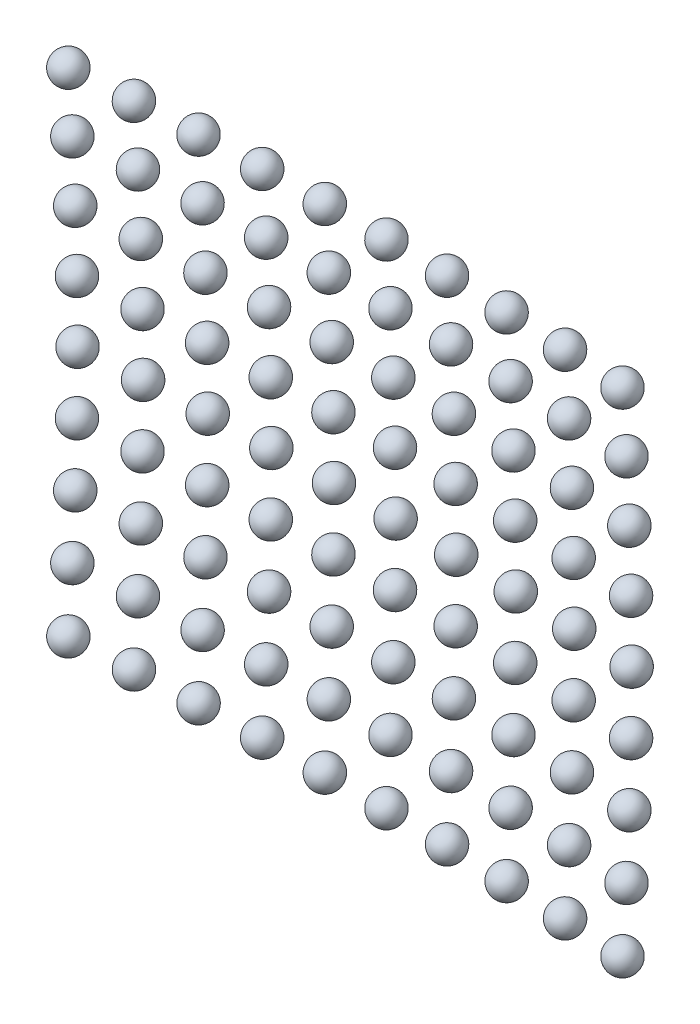
ISO-10303-21;
HEADER;
FILE_DESCRIPTION(('STEP AP214'),'2;1');
FILE_NAME('part.step','',(''),(''),'','','');
FILE_SCHEMA(('AUTOMOTIVE_DESIGN { 1 0 10303 214 1 1 1 1 }'));
ENDSEC;
DATA;
#1=APPLICATION_CONTEXT('core data for automotive mechanical design processes');
#2=APPLICATION_PROTOCOL_DEFINITION('international standard','automotive_design',2000,#1);
#3=PRODUCT_CONTEXT('',#1,'mechanical');
#4=PRODUCT('Part','Part','',(#3));
#5=PRODUCT_RELATED_PRODUCT_CATEGORY('part','',(#4));
#6=PRODUCT_DEFINITION_FORMATION('','',#4);
#7=PRODUCT_DEFINITION_CONTEXT('part definition',#1,'design');
#8=PRODUCT_DEFINITION('design','',#6,#7);
#9=PRODUCT_DEFINITION_SHAPE('','',#8);
#10=(LENGTH_UNIT() NAMED_UNIT(*) SI_UNIT(.MILLI.,.METRE.));
#11=(NAMED_UNIT(*) PLANE_ANGLE_UNIT() SI_UNIT($,.RADIAN.));
#12=(NAMED_UNIT(*) SI_UNIT($,.STERADIAN.) SOLID_ANGLE_UNIT());
#13=UNCERTAINTY_MEASURE_WITH_UNIT(LENGTH_MEASURE(1.E-05),#10,'distance_accuracy_value','');
#14=(GEOMETRIC_REPRESENTATION_CONTEXT(3) GLOBAL_UNCERTAINTY_ASSIGNED_CONTEXT((#13)) GLOBAL_UNIT_ASSIGNED_CONTEXT((#10,
#11,#12)) REPRESENTATION_CONTEXT('',''));
#15=CARTESIAN_POINT('',(0.,0.,0.));
#16=DIRECTION('',(0.,0.,1.));
#17=DIRECTION('',(1.,0.,0.));
#18=AXIS2_PLACEMENT_3D('',#15,#16,#17);
#19=CARTESIAN_POINT('',(8.00817179263602,-8.9214419487475,0.747647017793937));
#20=DIRECTION('',(0.,0.,-1.));
#21=DIRECTION('',(0.,-1.,0.));
#22=AXIS2_PLACEMENT_3D('',#19,#20,#21);
#23=SPHERICAL_SURFACE('',#22,0.5);
#24=CARTESIAN_POINT('',(8.00817179263602,-8.9214419487475,0.247647017793937));
#25=VERTEX_POINT('',#24);
#26=VERTEX_LOOP('',#25);
#27=FACE_BOUND('',#26,.T.);
#28=ADVANCED_FACE('F43',(#27),#23,.T.);
#29=CLOSED_SHELL('',(#28));
#30=MANIFOLD_SOLID_BREP('B2',#29);
#31=CARTESIAN_POINT('',(6.01259338943925,-8.9214419487475,0.615076387186788));
#32=DIRECTION('',(0.,0.,-1.));
#33=DIRECTION('',(0.,-1.,0.));
#34=AXIS2_PLACEMENT_3D('',#31,#32,#33);
#35=SPHERICAL_SURFACE('',#34,0.5);
#36=CARTESIAN_POINT('',(6.01259338943925,-8.9214419487475,0.115076387186788));
#37=VERTEX_POINT('',#36);
#38=VERTEX_LOOP('',#37);
#39=FACE_BOUND('',#38,.T.);
#40=ADVANCED_FACE('F63',(#39),#35,.T.);
#41=CLOSED_SHELL('',(#40));
#42=MANIFOLD_SOLID_BREP('B6',#41);
#43=CARTESIAN_POINT('',(4.01508925056326,-8.9214419487475,0.515651286844554));
#44=DIRECTION('',(0.,0.,-1.));
#45=DIRECTION('',(0.,-1.,0.));
#46=AXIS2_PLACEMENT_3D('',#43,#44,#45);
#47=SPHERICAL_SURFACE('',#46,0.5);
#48=CARTESIAN_POINT('',(4.01508925056326,-8.9214419487475,0.0156512868445537));
#49=VERTEX_POINT('',#48);
#50=VERTEX_LOOP('',#49);
#51=FACE_BOUND('',#50,.T.);
#52=ADVANCED_FACE('F83',(#51),#47,.T.);
#53=CLOSED_SHELL('',(#52));
#54=MANIFOLD_SOLID_BREP('B39',#53);
#55=CARTESIAN_POINT('',(2.01620986814937,-8.9214419487475,0.449399117329413));
#56=DIRECTION('',(0.,0.,-1.));
#57=DIRECTION('',(0.,-1.,0.));
#58=AXIS2_PLACEMENT_3D('',#55,#56,#57);
#59=SPHERICAL_SURFACE('',#58,0.5);
#60=CARTESIAN_POINT('',(2.01620986814937,-8.9214419487475,-0.0506008826705871));
#61=VERTEX_POINT('',#60);
#62=VERTEX_LOOP('',#61);
#63=FACE_BOUND('',#62,.T.);
#64=ADVANCED_FACE('F103',(#63),#59,.T.);
#65=CLOSED_SHELL('',(#64));
#66=MANIFOLD_SOLID_BREP('B59',#65);
#67=CARTESIAN_POINT('',(0.0165061133422777,-8.9214419487475,0.416338137075991));
#68=DIRECTION('',(0.,0.,-1.));
#69=DIRECTION('',(0.,-1.,0.));
#70=AXIS2_PLACEMENT_3D('',#67,#68,#69);
#71=SPHERICAL_SURFACE('',#70,0.5);
#72=CARTESIAN_POINT('',(0.0165061133422777,-8.9214419487475,-0.0836618629240086));
#73=VERTEX_POINT('',#72);
#74=VERTEX_LOOP('',#73);
#75=FACE_BOUND('',#74,.T.);
#76=ADVANCED_FACE('F123',(#75),#71,.T.);
#77=CLOSED_SHELL('',(#76));
#78=MANIFOLD_SOLID_BREP('B79',#77);
#79=CARTESIAN_POINT('',(-1.98347091552447,-8.9214419487475,0.416477457359412));
#80=DIRECTION('',(0.,0.,-1.));
#81=DIRECTION('',(0.,-1.,0.));
#82=AXIS2_PLACEMENT_3D('',#79,#80,#81);
#83=SPHERICAL_SURFACE('',#82,0.5);
#84=CARTESIAN_POINT('',(-1.98347091552447,-8.9214419487475,-0.0835225426405876));
#85=VERTEX_POINT('',#84);
#86=VERTEX_LOOP('',#85);
#87=FACE_BOUND('',#86,.T.);
#88=ADVANCED_FACE('F143',(#87),#83,.T.);
#89=CLOSED_SHELL('',(#88));
#90=MANIFOLD_SOLID_BREP('B99',#89);
#91=CARTESIAN_POINT('',(-3.98317004480583,-8.9214419487475,0.449817039784403));
#92=DIRECTION('',(0.,0.,-1.));
#93=DIRECTION('',(0.,-1.,0.));
#94=AXIS2_PLACEMENT_3D('',#91,#92,#93);
#95=SPHERICAL_SURFACE('',#94,0.5);
#96=CARTESIAN_POINT('',(-3.98317004480583,-8.9214419487475,-0.0501829602155971));
#97=VERTEX_POINT('',#96);
#98=VERTEX_LOOP('',#97);
#99=FACE_BOUND('',#98,.T.);
#100=ADVANCED_FACE('F163',(#99),#95,.T.);
#101=CLOSED_SHELL('',(#100));
#102=MANIFOLD_SOLID_BREP('B119',#101);
#103=CARTESIAN_POINT('',(-5.982040177443,-8.9214419487475,0.516347696295841));
#104=DIRECTION('',(0.,0.,-1.));
#105=DIRECTION('',(0.,-1.,0.));
#106=AXIS2_PLACEMENT_3D('',#103,#104,#105);
#107=SPHERICAL_SURFACE('',#106,0.5);
#108=CARTESIAN_POINT('',(-5.982040177443,-8.9214419487475,0.0163476962958405));
#109=VERTEX_POINT('',#108);
#110=VERTEX_LOOP('',#109);
#111=FACE_BOUND('',#110,.T.);
#112=ADVANCED_FACE('F183',(#111),#107,.T.);
#113=CLOSED_SHELL('',(#112));
#114=MANIFOLD_SOLID_BREP('B139',#113);
#115=CARTESIAN_POINT('',(-7.97953044484047,-8.9214419487475,0.616051091710923));
#116=DIRECTION('',(0.,0.,-1.));
#117=DIRECTION('',(0.,-1.,0.));
#118=AXIS2_PLACEMENT_3D('',#115,#116,#117);
#119=SPHERICAL_SURFACE('',#118,0.5);
#120=CARTESIAN_POINT('',(-7.97953044484047,-8.9214419487475,0.116051091710923));
#121=VERTEX_POINT('',#120);
#122=VERTEX_LOOP('',#121);
#123=FACE_BOUND('',#122,.T.);
#124=ADVANCED_FACE('F203',(#123),#119,.T.);
#125=CLOSED_SHELL('',(#124));
#126=MANIFOLD_SOLID_BREP('B159',#125);
#127=CARTESIAN_POINT('',(-9.97509035867965,-8.9214419487475,0.748899748772111));
#128=DIRECTION('',(0.,0.,-1.));
#129=DIRECTION('',(0.,-1.,0.));
#130=AXIS2_PLACEMENT_3D('',#127,#128,#129);
#131=SPHERICAL_SURFACE('',#130,0.5);
#132=CARTESIAN_POINT('',(-9.97509035867965,-8.9214419487475,0.248899748772111));
#133=VERTEX_POINT('',#132);
#134=VERTEX_LOOP('',#133);
#135=FACE_BOUND('',#134,.T.);
#136=ADVANCED_FACE('F223',(#135),#131,.T.);
#137=CLOSED_SHELL('',(#136));
#138=MANIFOLD_SOLID_BREP('B179',#137);
#139=CARTESIAN_POINT('',(8.00817179263602,-6.92569907133099,0.617666145492551));
#140=DIRECTION('',(0.,0.,-1.));
#141=DIRECTION('',(0.,-1.,0.));
#142=AXIS2_PLACEMENT_3D('',#139,#140,#141);
#143=SPHERICAL_SURFACE('',#142,0.5);
#144=CARTESIAN_POINT('',(8.00817179263602,-6.92569907133099,0.117666145492551));
#145=VERTEX_POINT('',#144);
#146=VERTEX_LOOP('',#145);
#147=FACE_BOUND('',#146,.T.);
#148=ADVANCED_FACE('F243',(#147),#143,.T.);
#149=CLOSED_SHELL('',(#148));
#150=MANIFOLD_SOLID_BREP('B199',#149);
#151=CARTESIAN_POINT('',(6.01259338943925,-6.92569907133099,0.485095514885403));
#152=DIRECTION('',(0.,0.,-1.));
#153=DIRECTION('',(0.,-1.,0.));
#154=AXIS2_PLACEMENT_3D('',#151,#152,#153);
#155=SPHERICAL_SURFACE('',#154,0.5);
#156=CARTESIAN_POINT('',(6.01259338943925,-6.92569907133099,-0.0149044851145972));
#157=VERTEX_POINT('',#156);
#158=VERTEX_LOOP('',#157);
#159=FACE_BOUND('',#158,.T.);
#160=ADVANCED_FACE('F263',(#159),#155,.T.);
#161=CLOSED_SHELL('',(#160));
#162=MANIFOLD_SOLID_BREP('B219',#161);
#163=CARTESIAN_POINT('',(4.01508925056326,-6.92569907133099,0.385670414543168));
#164=DIRECTION('',(0.,0.,-1.));
#165=DIRECTION('',(0.,-1.,0.));
#166=AXIS2_PLACEMENT_3D('',#163,#164,#165);
#167=SPHERICAL_SURFACE('',#166,0.5);
#168=CARTESIAN_POINT('',(4.01508925056326,-6.92569907133099,-0.114329585456832));
#169=VERTEX_POINT('',#168);
#170=VERTEX_LOOP('',#169);
#171=FACE_BOUND('',#170,.T.);
#172=ADVANCED_FACE('F283',(#171),#167,.T.);
#173=CLOSED_SHELL('',(#172));
#174=MANIFOLD_SOLID_BREP('B239',#173);
#175=CARTESIAN_POINT('',(2.01620986814937,-6.92569907133099,0.319418245028027));
#176=DIRECTION('',(0.,0.,-1.));
#177=DIRECTION('',(0.,-1.,0.));
#178=AXIS2_PLACEMENT_3D('',#175,#176,#177);
#179=SPHERICAL_SURFACE('',#178,0.5);
#180=CARTESIAN_POINT('',(2.01620986814937,-6.92569907133099,-0.180581754971973));
#181=VERTEX_POINT('',#180);
#182=VERTEX_LOOP('',#181);
#183=FACE_BOUND('',#182,.T.);
#184=ADVANCED_FACE('F303',(#183),#179,.T.);
#185=CLOSED_SHELL('',(#184));
#186=MANIFOLD_SOLID_BREP('B259',#185);
#187=CARTESIAN_POINT('',(0.0165061133422777,-6.92569907133099,0.286357264774606));
#188=DIRECTION('',(0.,0.,-1.));
#189=DIRECTION('',(0.,-1.,0.));
#190=AXIS2_PLACEMENT_3D('',#187,#188,#189);
#191=SPHERICAL_SURFACE('',#190,0.5);
#192=CARTESIAN_POINT('',(0.0165061133422777,-6.92569907133099,-0.213642735225394));
#193=VERTEX_POINT('',#192);
#194=VERTEX_LOOP('',#193);
#195=FACE_BOUND('',#194,.T.);
#196=ADVANCED_FACE('F323',(#195),#191,.T.);
#197=CLOSED_SHELL('',(#196));
#198=MANIFOLD_SOLID_BREP('B279',#197);
#199=CARTESIAN_POINT('',(-1.98347091552447,-6.92569907133099,0.286496585058027));
#200=DIRECTION('',(0.,0.,-1.));
#201=DIRECTION('',(0.,-1.,0.));
#202=AXIS2_PLACEMENT_3D('',#199,#200,#201);
#203=SPHERICAL_SURFACE('',#202,0.5);
#204=CARTESIAN_POINT('',(-1.98347091552447,-6.92569907133099,-0.213503414941973));
#205=VERTEX_POINT('',#204);
#206=VERTEX_LOOP('',#205);
#207=FACE_BOUND('',#206,.T.);
#208=ADVANCED_FACE('F343',(#207),#203,.T.);
#209=CLOSED_SHELL('',(#208));
#210=MANIFOLD_SOLID_BREP('B299',#209);
#211=CARTESIAN_POINT('',(-3.98317004480583,-6.92569907133099,0.319836167483017));
#212=DIRECTION('',(0.,0.,-1.));
#213=DIRECTION('',(0.,-1.,0.));
#214=AXIS2_PLACEMENT_3D('',#211,#212,#213);
#215=SPHERICAL_SURFACE('',#214,0.5);
#216=CARTESIAN_POINT('',(-3.98317004480583,-6.92569907133099,-0.180163832516983));
#217=VERTEX_POINT('',#216);
#218=VERTEX_LOOP('',#217);
#219=FACE_BOUND('',#218,.T.);
#220=ADVANCED_FACE('F363',(#219),#215,.T.);
#221=CLOSED_SHELL('',(#220));
#222=MANIFOLD_SOLID_BREP('B319',#221);
#223=CARTESIAN_POINT('',(-5.982040177443,-6.92569907133099,0.386366823994455));
#224=DIRECTION('',(0.,0.,-1.));
#225=DIRECTION('',(0.,-1.,0.));
#226=AXIS2_PLACEMENT_3D('',#223,#224,#225);
#227=SPHERICAL_SURFACE('',#226,0.5);
#228=CARTESIAN_POINT('',(-5.982040177443,-6.92569907133099,-0.113633176005545));
#229=VERTEX_POINT('',#228);
#230=VERTEX_LOOP('',#229);
#231=FACE_BOUND('',#230,.T.);
#232=ADVANCED_FACE('F383',(#231),#227,.T.);
#233=CLOSED_SHELL('',(#232));
#234=MANIFOLD_SOLID_BREP('B339',#233);
#235=CARTESIAN_POINT('',(-7.97953044484047,-6.92569907133099,0.486070219409537));
#236=DIRECTION('',(0.,0.,-1.));
#237=DIRECTION('',(0.,-1.,0.));
#238=AXIS2_PLACEMENT_3D('',#235,#236,#237);
#239=SPHERICAL_SURFACE('',#238,0.5);
#240=CARTESIAN_POINT('',(-7.97953044484047,-6.92569907133099,-0.0139297805904629));
#241=VERTEX_POINT('',#240);
#242=VERTEX_LOOP('',#241);
#243=FACE_BOUND('',#242,.T.);
#244=ADVANCED_FACE('F403',(#243),#239,.T.);
#245=CLOSED_SHELL('',(#244));
#246=MANIFOLD_SOLID_BREP('B359',#245);
#247=CARTESIAN_POINT('',(-9.97509035867965,-6.92569907133099,0.618918876470725));
#248=DIRECTION('',(0.,0.,-1.));
#249=DIRECTION('',(0.,-1.,0.));
#250=AXIS2_PLACEMENT_3D('',#247,#248,#249);
#251=SPHERICAL_SURFACE('',#250,0.5);
#252=CARTESIAN_POINT('',(-9.97509035867965,-6.92569907133099,0.118918876470725));
#253=VERTEX_POINT('',#252);
#254=VERTEX_LOOP('',#253);
#255=FACE_BOUND('',#254,.T.);
#256=ADVANCED_FACE('F423',(#255),#251,.T.);
#257=CLOSED_SHELL('',(#256));
#258=MANIFOLD_SOLID_BREP('B379',#257);
#259=CARTESIAN_POINT('',(8.00817179263602,-4.92788374246977,0.524829882696809));
#260=DIRECTION('',(0.,0.,-1.));
#261=DIRECTION('',(0.,-1.,0.));
#262=AXIS2_PLACEMENT_3D('',#259,#260,#261);
#263=SPHERICAL_SURFACE('',#262,0.5);
#264=CARTESIAN_POINT('',(8.00817179263602,-4.92788374246977,0.0248298826968087));
#265=VERTEX_POINT('',#264);
#266=VERTEX_LOOP('',#265);
#267=FACE_BOUND('',#266,.T.);
#268=ADVANCED_FACE('F443',(#267),#263,.T.);
#269=CLOSED_SHELL('',(#268));
#270=MANIFOLD_SOLID_BREP('B399',#269);
#271=CARTESIAN_POINT('',(6.01259338943925,-4.92788374246977,0.39225925208966));
#272=DIRECTION('',(0.,0.,-1.));
#273=DIRECTION('',(0.,-1.,0.));
#274=AXIS2_PLACEMENT_3D('',#271,#272,#273);
#275=SPHERICAL_SURFACE('',#274,0.5);
#276=CARTESIAN_POINT('',(6.01259338943925,-4.92788374246977,-0.10774074791034));
#277=VERTEX_POINT('',#276);
#278=VERTEX_LOOP('',#277);
#279=FACE_BOUND('',#278,.T.);
#280=ADVANCED_FACE('F463',(#279),#275,.T.);
#281=CLOSED_SHELL('',(#280));
#282=MANIFOLD_SOLID_BREP('B419',#281);
#283=CARTESIAN_POINT('',(4.01508925056326,-4.92788374246977,0.292834151747426));
#284=DIRECTION('',(0.,0.,-1.));
#285=DIRECTION('',(0.,-1.,0.));
#286=AXIS2_PLACEMENT_3D('',#283,#284,#285);
#287=SPHERICAL_SURFACE('',#286,0.5);
#288=CARTESIAN_POINT('',(4.01508925056326,-4.92788374246977,-0.207165848252574));
#289=VERTEX_POINT('',#288);
#290=VERTEX_LOOP('',#289);
#291=FACE_BOUND('',#290,.T.);
#292=ADVANCED_FACE('F483',(#291),#287,.T.);
#293=CLOSED_SHELL('',(#292));
#294=MANIFOLD_SOLID_BREP('B439',#293);
#295=CARTESIAN_POINT('',(2.01620986814937,-4.92788374246977,0.226581982232285));
#296=DIRECTION('',(0.,0.,-1.));
#297=DIRECTION('',(0.,-1.,0.));
#298=AXIS2_PLACEMENT_3D('',#295,#296,#297);
#299=SPHERICAL_SURFACE('',#298,0.5);
#300=CARTESIAN_POINT('',(2.01620986814937,-4.92788374246977,-0.273418017767715));
#301=VERTEX_POINT('',#300);
#302=VERTEX_LOOP('',#301);
#303=FACE_BOUND('',#302,.T.);
#304=ADVANCED_FACE('F503',(#303),#299,.T.);
#305=CLOSED_SHELL('',(#304));
#306=MANIFOLD_SOLID_BREP('B459',#305);
#307=CARTESIAN_POINT('',(0.0165061133422777,-4.92788374246977,0.193521001978863));
#308=DIRECTION('',(0.,0.,-1.));
#309=DIRECTION('',(0.,-1.,0.));
#310=AXIS2_PLACEMENT_3D('',#307,#308,#309);
#311=SPHERICAL_SURFACE('',#310,0.5);
#312=CARTESIAN_POINT('',(0.0165061133422777,-4.92788374246977,-0.306478998021137));
#313=VERTEX_POINT('',#312);
#314=VERTEX_LOOP('',#313);
#315=FACE_BOUND('',#314,.T.);
#316=ADVANCED_FACE('F523',(#315),#311,.T.);
#317=CLOSED_SHELL('',(#316));
#318=MANIFOLD_SOLID_BREP('B479',#317);
#319=CARTESIAN_POINT('',(-1.98347091552447,-4.92788374246977,0.193660322262284));
#320=DIRECTION('',(0.,0.,-1.));
#321=DIRECTION('',(0.,-1.,0.));
#322=AXIS2_PLACEMENT_3D('',#319,#320,#321);
#323=SPHERICAL_SURFACE('',#322,0.5);
#324=CARTESIAN_POINT('',(-1.98347091552447,-4.92788374246977,-0.306339677737716));
#325=VERTEX_POINT('',#324);
#326=VERTEX_LOOP('',#325);
#327=FACE_BOUND('',#326,.T.);
#328=ADVANCED_FACE('F543',(#327),#323,.T.);
#329=CLOSED_SHELL('',(#328));
#330=MANIFOLD_SOLID_BREP('B499',#329);
#331=CARTESIAN_POINT('',(-3.98317004480583,-4.92788374246977,0.226999904687275));
#332=DIRECTION('',(0.,0.,-1.));
#333=DIRECTION('',(0.,-1.,0.));
#334=AXIS2_PLACEMENT_3D('',#331,#332,#333);
#335=SPHERICAL_SURFACE('',#334,0.5);
#336=CARTESIAN_POINT('',(-3.98317004480583,-4.92788374246977,-0.273000095312725));
#337=VERTEX_POINT('',#336);
#338=VERTEX_LOOP('',#337);
#339=FACE_BOUND('',#338,.T.);
#340=ADVANCED_FACE('F563',(#339),#335,.T.);
#341=CLOSED_SHELL('',(#340));
#342=MANIFOLD_SOLID_BREP('B519',#341);
#343=CARTESIAN_POINT('',(-5.982040177443,-4.92788374246977,0.293530561198712));
#344=DIRECTION('',(0.,0.,-1.));
#345=DIRECTION('',(0.,-1.,0.));
#346=AXIS2_PLACEMENT_3D('',#343,#344,#345);
#347=SPHERICAL_SURFACE('',#346,0.5);
#348=CARTESIAN_POINT('',(-5.982040177443,-4.92788374246977,-0.206469438801288));
#349=VERTEX_POINT('',#348);
#350=VERTEX_LOOP('',#349);
#351=FACE_BOUND('',#350,.T.);
#352=ADVANCED_FACE('F583',(#351),#347,.T.);
#353=CLOSED_SHELL('',(#352));
#354=MANIFOLD_SOLID_BREP('B539',#353);
#355=CARTESIAN_POINT('',(-7.97953044484047,-4.92788374246977,0.393233956613795));
#356=DIRECTION('',(0.,0.,-1.));
#357=DIRECTION('',(0.,-1.,0.));
#358=AXIS2_PLACEMENT_3D('',#355,#356,#357);
#359=SPHERICAL_SURFACE('',#358,0.5);
#360=CARTESIAN_POINT('',(-7.97953044484047,-4.92788374246977,-0.106766043386205));
#361=VERTEX_POINT('',#360);
#362=VERTEX_LOOP('',#361);
#363=FACE_BOUND('',#362,.T.);
#364=ADVANCED_FACE('F603',(#363),#359,.T.);
#365=CLOSED_SHELL('',(#364));
#366=MANIFOLD_SOLID_BREP('B559',#365);
#367=CARTESIAN_POINT('',(-9.97509035867965,-4.92788374246977,0.526082613674983));
#368=DIRECTION('',(0.,0.,-1.));
#369=DIRECTION('',(0.,-1.,0.));
#370=AXIS2_PLACEMENT_3D('',#367,#368,#369);
#371=SPHERICAL_SURFACE('',#370,0.5);
#372=CARTESIAN_POINT('',(-9.97509035867965,-4.92788374246977,0.0260826136749828));
#373=VERTEX_POINT('',#372);
#374=VERTEX_LOOP('',#373);
#375=FACE_BOUND('',#374,.T.);
#376=ADVANCED_FACE('F623',(#375),#371,.T.);
#377=CLOSED_SHELL('',(#376));
#378=MANIFOLD_SOLID_BREP('B579',#377);
#379=CARTESIAN_POINT('',(8.00817179263602,-2.92868723472621,0.469170352076081));
#380=DIRECTION('',(0.,0.,-1.));
#381=DIRECTION('',(0.,-1.,0.));
#382=AXIS2_PLACEMENT_3D('',#379,#380,#381);
#383=SPHERICAL_SURFACE('',#382,0.5);
#384=CARTESIAN_POINT('',(8.00817179263602,-2.92868723472621,-0.0308296479239187));
#385=VERTEX_POINT('',#384);
#386=VERTEX_LOOP('',#385);
#387=FACE_BOUND('',#386,.T.);
#388=ADVANCED_FACE('F643',(#387),#383,.T.);
#389=CLOSED_SHELL('',(#388));
#390=MANIFOLD_SOLID_BREP('B599',#389);
#391=CARTESIAN_POINT('',(6.01259338943925,-2.92868723472621,0.336599721468933));
#392=DIRECTION('',(0.,0.,-1.));
#393=DIRECTION('',(0.,-1.,0.));
#394=AXIS2_PLACEMENT_3D('',#391,#392,#393);
#395=SPHERICAL_SURFACE('',#394,0.5);
#396=CARTESIAN_POINT('',(6.01259338943925,-2.92868723472621,-0.163400278531067));
#397=VERTEX_POINT('',#396);
#398=VERTEX_LOOP('',#397);
#399=FACE_BOUND('',#398,.T.);
#400=ADVANCED_FACE('F663',(#399),#395,.T.);
#401=CLOSED_SHELL('',(#400));
#402=MANIFOLD_SOLID_BREP('B619',#401);
#403=CARTESIAN_POINT('',(4.01508925056326,-2.92868723472621,0.237174621126698));
#404=DIRECTION('',(0.,0.,-1.));
#405=DIRECTION('',(0.,-1.,0.));
#406=AXIS2_PLACEMENT_3D('',#403,#404,#405);
#407=SPHERICAL_SURFACE('',#406,0.5);
#408=CARTESIAN_POINT('',(4.01508925056326,-2.92868723472621,-0.262825378873302));
#409=VERTEX_POINT('',#408);
#410=VERTEX_LOOP('',#409);
#411=FACE_BOUND('',#410,.T.);
#412=ADVANCED_FACE('F683',(#411),#407,.T.);
#413=CLOSED_SHELL('',(#412));
#414=MANIFOLD_SOLID_BREP('B639',#413);
#415=CARTESIAN_POINT('',(2.01620986814937,-2.92868723472621,0.170922451611557));
#416=DIRECTION('',(0.,0.,-1.));
#417=DIRECTION('',(0.,-1.,0.));
#418=AXIS2_PLACEMENT_3D('',#415,#416,#417);
#419=SPHERICAL_SURFACE('',#418,0.5);
#420=CARTESIAN_POINT('',(2.01620986814937,-2.92868723472621,-0.329077548388443));
#421=VERTEX_POINT('',#420);
#422=VERTEX_LOOP('',#421);
#423=FACE_BOUND('',#422,.T.);
#424=ADVANCED_FACE('F703',(#423),#419,.T.);
#425=CLOSED_SHELL('',(#424));
#426=MANIFOLD_SOLID_BREP('B659',#425);
#427=CARTESIAN_POINT('',(0.0165061133422777,-2.92868723472621,0.137861471358136));
#428=DIRECTION('',(0.,0.,-1.));
#429=DIRECTION('',(0.,-1.,0.));
#430=AXIS2_PLACEMENT_3D('',#427,#428,#429);
#431=SPHERICAL_SURFACE('',#430,0.5);
#432=CARTESIAN_POINT('',(0.0165061133422777,-2.92868723472621,-0.362138528641864));
#433=VERTEX_POINT('',#432);
#434=VERTEX_LOOP('',#433);
#435=FACE_BOUND('',#434,.T.);
#436=ADVANCED_FACE('F723',(#435),#431,.T.);
#437=CLOSED_SHELL('',(#436));
#438=MANIFOLD_SOLID_BREP('B679',#437);
#439=CARTESIAN_POINT('',(-1.98347091552447,-2.92868723472621,0.138000791641557));
#440=DIRECTION('',(0.,0.,-1.));
#441=DIRECTION('',(0.,-1.,0.));
#442=AXIS2_PLACEMENT_3D('',#439,#440,#441);
#443=SPHERICAL_SURFACE('',#442,0.5);
#444=CARTESIAN_POINT('',(-1.98347091552447,-2.92868723472621,-0.361999208358443));
#445=VERTEX_POINT('',#444);
#446=VERTEX_LOOP('',#445);
#447=FACE_BOUND('',#446,.T.);
#448=ADVANCED_FACE('F743',(#447),#443,.T.);
#449=CLOSED_SHELL('',(#448));
#450=MANIFOLD_SOLID_BREP('B699',#449);
#451=CARTESIAN_POINT('',(-3.98317004480583,-2.92868723472621,0.171340374066547));
#452=DIRECTION('',(0.,0.,-1.));
#453=DIRECTION('',(0.,-1.,0.));
#454=AXIS2_PLACEMENT_3D('',#451,#452,#453);
#455=SPHERICAL_SURFACE('',#454,0.5);
#456=CARTESIAN_POINT('',(-3.98317004480583,-2.92868723472621,-0.328659625933453));
#457=VERTEX_POINT('',#456);
#458=VERTEX_LOOP('',#457);
#459=FACE_BOUND('',#458,.T.);
#460=ADVANCED_FACE('F763',(#459),#455,.T.);
#461=CLOSED_SHELL('',(#460));
#462=MANIFOLD_SOLID_BREP('B719',#461);
#463=CARTESIAN_POINT('',(-5.982040177443,-2.92868723472621,0.237871030577985));
#464=DIRECTION('',(0.,0.,-1.));
#465=DIRECTION('',(0.,-1.,0.));
#466=AXIS2_PLACEMENT_3D('',#463,#464,#465);
#467=SPHERICAL_SURFACE('',#466,0.5);
#468=CARTESIAN_POINT('',(-5.982040177443,-2.92868723472621,-0.262128969422015));
#469=VERTEX_POINT('',#468);
#470=VERTEX_LOOP('',#469);
#471=FACE_BOUND('',#470,.T.);
#472=ADVANCED_FACE('F783',(#471),#467,.T.);
#473=CLOSED_SHELL('',(#472));
#474=MANIFOLD_SOLID_BREP('B739',#473);
#475=CARTESIAN_POINT('',(-7.97953044484047,-2.92868723472621,0.337574425993067));
#476=DIRECTION('',(0.,0.,-1.));
#477=DIRECTION('',(0.,-1.,0.));
#478=AXIS2_PLACEMENT_3D('',#475,#476,#477);
#479=SPHERICAL_SURFACE('',#478,0.5);
#480=CARTESIAN_POINT('',(-7.97953044484047,-2.92868723472621,-0.162425574006933));
#481=VERTEX_POINT('',#480);
#482=VERTEX_LOOP('',#481);
#483=FACE_BOUND('',#482,.T.);
#484=ADVANCED_FACE('F803',(#483),#479,.T.);
#485=CLOSED_SHELL('',(#484));
#486=MANIFOLD_SOLID_BREP('B759',#485);
#487=CARTESIAN_POINT('',(-9.97509035867965,-2.92868723472621,0.470423083054255));
#488=DIRECTION('',(0.,0.,-1.));
#489=DIRECTION('',(0.,-1.,0.));
#490=AXIS2_PLACEMENT_3D('',#487,#488,#489);
#491=SPHERICAL_SURFACE('',#490,0.5);
#492=CARTESIAN_POINT('',(-9.97509035867965,-2.92868723472621,-0.0295769169457447));
#493=VERTEX_POINT('',#492);
#494=VERTEX_LOOP('',#493);
#495=FACE_BOUND('',#494,.T.);
#496=ADVANCED_FACE('F823',(#495),#491,.T.);
#497=CLOSED_SHELL('',(#496));
#498=MANIFOLD_SOLID_BREP('B779',#497);
#499=CARTESIAN_POINT('',(8.00817179263602,-0.928801298570512,0.450706812620813));
#500=DIRECTION('',(0.,0.,-1.));
#501=DIRECTION('',(0.,-1.,0.));
#502=AXIS2_PLACEMENT_3D('',#499,#500,#501);
#503=SPHERICAL_SURFACE('',#502,0.5);
#504=CARTESIAN_POINT('',(8.00817179263602,-0.928801298570512,-0.0492931873791872));
#505=VERTEX_POINT('',#504);
#506=VERTEX_LOOP('',#505);
#507=FACE_BOUND('',#506,.T.);
#508=ADVANCED_FACE('F843',(#507),#503,.T.);
#509=CLOSED_SHELL('',(#508));
#510=MANIFOLD_SOLID_BREP('B799',#509);
#511=CARTESIAN_POINT('',(6.01259338943925,-0.928801298570512,0.318136182013664));
#512=DIRECTION('',(0.,0.,-1.));
#513=DIRECTION('',(0.,-1.,0.));
#514=AXIS2_PLACEMENT_3D('',#511,#512,#513);
#515=SPHERICAL_SURFACE('',#514,0.5);
#516=CARTESIAN_POINT('',(6.01259338943925,-0.928801298570512,-0.181863817986336));
#517=VERTEX_POINT('',#516);
#518=VERTEX_LOOP('',#517);
#519=FACE_BOUND('',#518,.T.);
#520=ADVANCED_FACE('F863',(#519),#515,.T.);
#521=CLOSED_SHELL('',(#520));
#522=MANIFOLD_SOLID_BREP('B819',#521);
#523=CARTESIAN_POINT('',(4.01508925056326,-0.928801298570512,0.21871108167143));
#524=DIRECTION('',(0.,0.,-1.));
#525=DIRECTION('',(0.,-1.,0.));
#526=AXIS2_PLACEMENT_3D('',#523,#524,#525);
#527=SPHERICAL_SURFACE('',#526,0.5);
#528=CARTESIAN_POINT('',(4.01508925056326,-0.928801298570512,-0.28128891832857));
#529=VERTEX_POINT('',#528);
#530=VERTEX_LOOP('',#529);
#531=FACE_BOUND('',#530,.T.);
#532=ADVANCED_FACE('F883',(#531),#527,.T.);
#533=CLOSED_SHELL('',(#532));
#534=MANIFOLD_SOLID_BREP('B839',#533);
#535=CARTESIAN_POINT('',(2.01620986814937,-0.928801298570512,0.152458912156289));
#536=DIRECTION('',(0.,0.,-1.));
#537=DIRECTION('',(0.,-1.,0.));
#538=AXIS2_PLACEMENT_3D('',#535,#536,#537);
#539=SPHERICAL_SURFACE('',#538,0.5);
#540=CARTESIAN_POINT('',(2.01620986814937,-0.928801298570512,-0.347541087843711));
#541=VERTEX_POINT('',#540);
#542=VERTEX_LOOP('',#541);
#543=FACE_BOUND('',#542,.T.);
#544=ADVANCED_FACE('F903',(#543),#539,.T.);
#545=CLOSED_SHELL('',(#544));
#546=MANIFOLD_SOLID_BREP('B859',#545);
#547=CARTESIAN_POINT('',(0.0165061133422777,-0.928801298570512,0.119397931902867));
#548=DIRECTION('',(0.,0.,-1.));
#549=DIRECTION('',(0.,-1.,0.));
#550=AXIS2_PLACEMENT_3D('',#547,#548,#549);
#551=SPHERICAL_SURFACE('',#550,0.5);
#552=CARTESIAN_POINT('',(0.0165061133422777,-0.928801298570512,-0.380602068097133));
#553=VERTEX_POINT('',#552);
#554=VERTEX_LOOP('',#553);
#555=FACE_BOUND('',#554,.T.);
#556=ADVANCED_FACE('F923',(#555),#551,.T.);
#557=CLOSED_SHELL('',(#556));
#558=MANIFOLD_SOLID_BREP('B879',#557);
#559=CARTESIAN_POINT('',(-1.98347091552447,-0.928801298570512,0.119537252186288));
#560=DIRECTION('',(0.,0.,-1.));
#561=DIRECTION('',(0.,-1.,0.));
#562=AXIS2_PLACEMENT_3D('',#559,#560,#561);
#563=SPHERICAL_SURFACE('',#562,0.5);
#564=CARTESIAN_POINT('',(-1.98347091552447,-0.928801298570512,-0.380462747813712));
#565=VERTEX_POINT('',#564);
#566=VERTEX_LOOP('',#565);
#567=FACE_BOUND('',#566,.T.);
#568=ADVANCED_FACE('F943',(#567),#563,.T.);
#569=CLOSED_SHELL('',(#568));
#570=MANIFOLD_SOLID_BREP('B899',#569);
#571=CARTESIAN_POINT('',(-3.98317004480583,-0.928801298570512,0.152876834611279));
#572=DIRECTION('',(0.,0.,-1.));
#573=DIRECTION('',(0.,-1.,0.));
#574=AXIS2_PLACEMENT_3D('',#571,#572,#573);
#575=SPHERICAL_SURFACE('',#574,0.5);
#576=CARTESIAN_POINT('',(-3.98317004480583,-0.928801298570512,-0.347123165388721));
#577=VERTEX_POINT('',#576);
#578=VERTEX_LOOP('',#577);
#579=FACE_BOUND('',#578,.T.);
#580=ADVANCED_FACE('F963',(#579),#575,.T.);
#581=CLOSED_SHELL('',(#580));
#582=MANIFOLD_SOLID_BREP('B919',#581);
#583=CARTESIAN_POINT('',(-5.982040177443,-0.928801298570512,0.219407491122717));
#584=DIRECTION('',(0.,0.,-1.));
#585=DIRECTION('',(0.,-1.,0.));
#586=AXIS2_PLACEMENT_3D('',#583,#584,#585);
#587=SPHERICAL_SURFACE('',#586,0.5);
#588=CARTESIAN_POINT('',(-5.982040177443,-0.928801298570512,-0.280592508877283));
#589=VERTEX_POINT('',#588);
#590=VERTEX_LOOP('',#589);
#591=FACE_BOUND('',#590,.T.);
#592=ADVANCED_FACE('F983',(#591),#587,.T.);
#593=CLOSED_SHELL('',(#592));
#594=MANIFOLD_SOLID_BREP('B939',#593);
#595=CARTESIAN_POINT('',(-7.97953044484047,-0.928801298570512,0.319110886537799));
#596=DIRECTION('',(0.,0.,-1.));
#597=DIRECTION('',(0.,-1.,0.));
#598=AXIS2_PLACEMENT_3D('',#595,#596,#597);
#599=SPHERICAL_SURFACE('',#598,0.5);
#600=CARTESIAN_POINT('',(-7.97953044484047,-0.928801298570512,-0.180889113462201));
#601=VERTEX_POINT('',#600);
#602=VERTEX_LOOP('',#601);
#603=FACE_BOUND('',#602,.T.);
#604=ADVANCED_FACE('F1003',(#603),#599,.T.);
#605=CLOSED_SHELL('',(#604));
#606=MANIFOLD_SOLID_BREP('B959',#605);
#607=CARTESIAN_POINT('',(-9.97509035867965,-0.928801298570512,0.451959543598987));
#608=DIRECTION('',(0.,0.,-1.));
#609=DIRECTION('',(0.,-1.,0.));
#610=AXIS2_PLACEMENT_3D('',#607,#608,#609);
#611=SPHERICAL_SURFACE('',#610,0.5);
#612=CARTESIAN_POINT('',(-9.97509035867965,-0.928801298570512,-0.0480404564010132));
#613=VERTEX_POINT('',#612);
#614=VERTEX_LOOP('',#613);
#615=FACE_BOUND('',#614,.T.);
#616=ADVANCED_FACE('F1023',(#615),#611,.T.);
#617=CLOSED_SHELL('',(#616));
#618=MANIFOLD_SOLID_BREP('B979',#617);
#619=CARTESIAN_POINT('',(8.00817179263602,1.07108207697542,0.469445652978698));
#620=DIRECTION('',(0.,0.,-1.));
#621=DIRECTION('',(0.,-1.,0.));
#622=AXIS2_PLACEMENT_3D('',#619,#620,#621);
#623=SPHERICAL_SURFACE('',#622,0.5);
#624=CARTESIAN_POINT('',(8.00817179263602,1.07108207697542,-0.0305543470213024));
#625=VERTEX_POINT('',#624);
#626=VERTEX_LOOP('',#625);
#627=FACE_BOUND('',#626,.T.);
#628=ADVANCED_FACE('F1043',(#627),#623,.T.);
#629=CLOSED_SHELL('',(#628));
#630=MANIFOLD_SOLID_BREP('B999',#629);
#631=CARTESIAN_POINT('',(6.01259338943925,1.07108207697542,0.336875022371549));
#632=DIRECTION('',(0.,0.,-1.));
#633=DIRECTION('',(0.,-1.,0.));
#634=AXIS2_PLACEMENT_3D('',#631,#632,#633);
#635=SPHERICAL_SURFACE('',#634,0.5);
#636=CARTESIAN_POINT('',(6.01259338943925,1.07108207697542,-0.163124977628451));
#637=VERTEX_POINT('',#636);
#638=VERTEX_LOOP('',#637);
#639=FACE_BOUND('',#638,.T.);
#640=ADVANCED_FACE('F1063',(#639),#635,.T.);
#641=CLOSED_SHELL('',(#640));
#642=MANIFOLD_SOLID_BREP('B1019',#641);
#643=CARTESIAN_POINT('',(4.01508925056326,1.07108207697542,0.237449922029314));
#644=DIRECTION('',(0.,0.,-1.));
#645=DIRECTION('',(0.,-1.,0.));
#646=AXIS2_PLACEMENT_3D('',#643,#644,#645);
#647=SPHERICAL_SURFACE('',#646,0.5);
#648=CARTESIAN_POINT('',(4.01508925056326,1.07108207697542,-0.262550077970686));
#649=VERTEX_POINT('',#648);
#650=VERTEX_LOOP('',#649);
#651=FACE_BOUND('',#650,.T.);
#652=ADVANCED_FACE('F1083',(#651),#647,.T.);
#653=CLOSED_SHELL('',(#652));
#654=MANIFOLD_SOLID_BREP('B1039',#653);
#655=CARTESIAN_POINT('',(2.01620986814937,1.07108207697542,0.171197752514174));
#656=DIRECTION('',(0.,0.,-1.));
#657=DIRECTION('',(0.,-1.,0.));
#658=AXIS2_PLACEMENT_3D('',#655,#656,#657);
#659=SPHERICAL_SURFACE('',#658,0.5);
#660=CARTESIAN_POINT('',(2.01620986814937,1.07108207697542,-0.328802247485826));
#661=VERTEX_POINT('',#660);
#662=VERTEX_LOOP('',#661);
#663=FACE_BOUND('',#662,.T.);
#664=ADVANCED_FACE('F1103',(#663),#659,.T.);
#665=CLOSED_SHELL('',(#664));
#666=MANIFOLD_SOLID_BREP('B1059',#665);
#667=CARTESIAN_POINT('',(0.0165061133422777,1.07108207697542,0.138136772260752));
#668=DIRECTION('',(0.,0.,-1.));
#669=DIRECTION('',(0.,-1.,0.));
#670=AXIS2_PLACEMENT_3D('',#667,#668,#669);
#671=SPHERICAL_SURFACE('',#670,0.5);
#672=CARTESIAN_POINT('',(0.0165061133422777,1.07108207697542,-0.361863227739248));
#673=VERTEX_POINT('',#672);
#674=VERTEX_LOOP('',#673);
#675=FACE_BOUND('',#674,.T.);
#676=ADVANCED_FACE('F1123',(#675),#671,.T.);
#677=CLOSED_SHELL('',(#676));
#678=MANIFOLD_SOLID_BREP('B1079',#677);
#679=CARTESIAN_POINT('',(-1.98347091552447,1.07108207697542,0.138276092544173));
#680=DIRECTION('',(0.,0.,-1.));
#681=DIRECTION('',(0.,-1.,0.));
#682=AXIS2_PLACEMENT_3D('',#679,#680,#681);
#683=SPHERICAL_SURFACE('',#682,0.5);
#684=CARTESIAN_POINT('',(-1.98347091552447,1.07108207697542,-0.361723907455827));
#685=VERTEX_POINT('',#684);
#686=VERTEX_LOOP('',#685);
#687=FACE_BOUND('',#686,.T.);
#688=ADVANCED_FACE('F1143',(#687),#683,.T.);
#689=CLOSED_SHELL('',(#688));
#690=MANIFOLD_SOLID_BREP('B1099',#689);
#691=CARTESIAN_POINT('',(-3.98317004480583,1.07108207697542,0.171615674969164));
#692=DIRECTION('',(0.,0.,-1.));
#693=DIRECTION('',(0.,-1.,0.));
#694=AXIS2_PLACEMENT_3D('',#691,#692,#693);
#695=SPHERICAL_SURFACE('',#694,0.5);
#696=CARTESIAN_POINT('',(-3.98317004480583,1.07108207697542,-0.328384325030836));
#697=VERTEX_POINT('',#696);
#698=VERTEX_LOOP('',#697);
#699=FACE_BOUND('',#698,.T.);
#700=ADVANCED_FACE('F1163',(#699),#695,.T.);
#701=CLOSED_SHELL('',(#700));
#702=MANIFOLD_SOLID_BREP('B1119',#701);
#703=CARTESIAN_POINT('',(-5.982040177443,1.07108207697542,0.238146331480601));
#704=DIRECTION('',(0.,0.,-1.));
#705=DIRECTION('',(0.,-1.,0.));
#706=AXIS2_PLACEMENT_3D('',#703,#704,#705);
#707=SPHERICAL_SURFACE('',#706,0.5);
#708=CARTESIAN_POINT('',(-5.982040177443,1.07108207697542,-0.261853668519399));
#709=VERTEX_POINT('',#708);
#710=VERTEX_LOOP('',#709);
#711=FACE_BOUND('',#710,.T.);
#712=ADVANCED_FACE('F1183',(#711),#707,.T.);
#713=CLOSED_SHELL('',(#712));
#714=MANIFOLD_SOLID_BREP('B1139',#713);
#715=CARTESIAN_POINT('',(-7.97953044484047,1.07108207697542,0.337849726895683));
#716=DIRECTION('',(0.,0.,-1.));
#717=DIRECTION('',(0.,-1.,0.));
#718=AXIS2_PLACEMENT_3D('',#715,#716,#717);
#719=SPHERICAL_SURFACE('',#718,0.5);
#720=CARTESIAN_POINT('',(-7.97953044484047,1.07108207697542,-0.162150273104317));
#721=VERTEX_POINT('',#720);
#722=VERTEX_LOOP('',#721);
#723=FACE_BOUND('',#722,.T.);
#724=ADVANCED_FACE('F1203',(#723),#719,.T.);
#725=CLOSED_SHELL('',(#724));
#726=MANIFOLD_SOLID_BREP('B1159',#725);
#727=CARTESIAN_POINT('',(-9.97509035867965,1.07108207697542,0.470698383956872));
#728=DIRECTION('',(0.,0.,-1.));
#729=DIRECTION('',(0.,-1.,0.));
#730=AXIS2_PLACEMENT_3D('',#727,#728,#729);
#731=SPHERICAL_SURFACE('',#730,0.5);
#732=CARTESIAN_POINT('',(-9.97509035867965,1.07108207697542,-0.0293016160431284));
#733=VERTEX_POINT('',#732);
#734=VERTEX_LOOP('',#733);
#735=FACE_BOUND('',#734,.T.);
#736=ADVANCED_FACE('F1223',(#735),#731,.T.);
#737=CLOSED_SHELL('',(#736));
#738=MANIFOLD_SOLID_BREP('B1179',#737);
#739=CARTESIAN_POINT('',(8.00817179263602,3.07027090377535,0.525380389244004));
#740=DIRECTION('',(0.,0.,-1.));
#741=DIRECTION('',(0.,-1.,0.));
#742=AXIS2_PLACEMENT_3D('',#739,#740,#741);
#743=SPHERICAL_SURFACE('',#742,0.5);
#744=CARTESIAN_POINT('',(8.00817179263602,3.07027090377535,0.0253803892440038));
#745=VERTEX_POINT('',#744);
#746=VERTEX_LOOP('',#745);
#747=FACE_BOUND('',#746,.T.);
#748=ADVANCED_FACE('F1243',(#747),#743,.T.);
#749=CLOSED_SHELL('',(#748));
#750=MANIFOLD_SOLID_BREP('B1199',#749);
#751=CARTESIAN_POINT('',(6.01259338943925,3.07027090377535,0.392809758636855));
#752=DIRECTION('',(0.,0.,-1.));
#753=DIRECTION('',(0.,-1.,0.));
#754=AXIS2_PLACEMENT_3D('',#751,#752,#753);
#755=SPHERICAL_SURFACE('',#754,0.5);
#756=CARTESIAN_POINT('',(6.01259338943925,3.07027090377535,-0.107190241363145));
#757=VERTEX_POINT('',#756);
#758=VERTEX_LOOP('',#757);
#759=FACE_BOUND('',#758,.T.);
#760=ADVANCED_FACE('F1263',(#759),#755,.T.);
#761=CLOSED_SHELL('',(#760));
#762=MANIFOLD_SOLID_BREP('B1219',#761);
#763=CARTESIAN_POINT('',(4.01508925056326,3.07027090377535,0.293384658294621));
#764=DIRECTION('',(0.,0.,-1.));
#765=DIRECTION('',(0.,-1.,0.));
#766=AXIS2_PLACEMENT_3D('',#763,#764,#765);
#767=SPHERICAL_SURFACE('',#766,0.5);
#768=CARTESIAN_POINT('',(4.01508925056326,3.07027090377535,-0.206615341705379));
#769=VERTEX_POINT('',#768);
#770=VERTEX_LOOP('',#769);
#771=FACE_BOUND('',#770,.T.);
#772=ADVANCED_FACE('F1283',(#771),#767,.T.);
#773=CLOSED_SHELL('',(#772));
#774=MANIFOLD_SOLID_BREP('B1239',#773);
#775=CARTESIAN_POINT('',(2.01620986814937,3.07027090377535,0.22713248877948));
#776=DIRECTION('',(0.,0.,-1.));
#777=DIRECTION('',(0.,-1.,0.));
#778=AXIS2_PLACEMENT_3D('',#775,#776,#777);
#779=SPHERICAL_SURFACE('',#778,0.5);
#780=CARTESIAN_POINT('',(2.01620986814937,3.07027090377535,-0.27286751122052));
#781=VERTEX_POINT('',#780);
#782=VERTEX_LOOP('',#781);
#783=FACE_BOUND('',#782,.T.);
#784=ADVANCED_FACE('F1303',(#783),#779,.T.);
#785=CLOSED_SHELL('',(#784));
#786=MANIFOLD_SOLID_BREP('B1259',#785);
#787=CARTESIAN_POINT('',(0.0165061133422777,3.07027090377535,0.194071508526058));
#788=DIRECTION('',(0.,0.,-1.));
#789=DIRECTION('',(0.,-1.,0.));
#790=AXIS2_PLACEMENT_3D('',#787,#788,#789);
#791=SPHERICAL_SURFACE('',#790,0.5);
#792=CARTESIAN_POINT('',(0.0165061133422777,3.07027090377535,-0.305928491473942));
#793=VERTEX_POINT('',#792);
#794=VERTEX_LOOP('',#793);
#795=FACE_BOUND('',#794,.T.);
#796=ADVANCED_FACE('F1323',(#795),#791,.T.);
#797=CLOSED_SHELL('',(#796));
#798=MANIFOLD_SOLID_BREP('B1279',#797);
#799=CARTESIAN_POINT('',(-1.98347091552447,3.07027090377535,0.194210828809479));
#800=DIRECTION('',(0.,0.,-1.));
#801=DIRECTION('',(0.,-1.,0.));
#802=AXIS2_PLACEMENT_3D('',#799,#800,#801);
#803=SPHERICAL_SURFACE('',#802,0.5);
#804=CARTESIAN_POINT('',(-1.98347091552447,3.07027090377535,-0.305789171190521));
#805=VERTEX_POINT('',#804);
#806=VERTEX_LOOP('',#805);
#807=FACE_BOUND('',#806,.T.);
#808=ADVANCED_FACE('F1343',(#807),#803,.T.);
#809=CLOSED_SHELL('',(#808));
#810=MANIFOLD_SOLID_BREP('B1299',#809);
#811=CARTESIAN_POINT('',(-3.98317004480583,3.07027090377535,0.22755041123447));
#812=DIRECTION('',(0.,0.,-1.));
#813=DIRECTION('',(0.,-1.,0.));
#814=AXIS2_PLACEMENT_3D('',#811,#812,#813);
#815=SPHERICAL_SURFACE('',#814,0.5);
#816=CARTESIAN_POINT('',(-3.98317004480583,3.07027090377535,-0.27244958876553));
#817=VERTEX_POINT('',#816);
#818=VERTEX_LOOP('',#817);
#819=FACE_BOUND('',#818,.T.);
#820=ADVANCED_FACE('F1363',(#819),#815,.T.);
#821=CLOSED_SHELL('',(#820));
#822=MANIFOLD_SOLID_BREP('B1319',#821);
#823=CARTESIAN_POINT('',(-5.982040177443,3.07027090377535,0.294081067745907));
#824=DIRECTION('',(0.,0.,-1.));
#825=DIRECTION('',(0.,-1.,0.));
#826=AXIS2_PLACEMENT_3D('',#823,#824,#825);
#827=SPHERICAL_SURFACE('',#826,0.5);
#828=CARTESIAN_POINT('',(-5.982040177443,3.07027090377535,-0.205918932254093));
#829=VERTEX_POINT('',#828);
#830=VERTEX_LOOP('',#829);
#831=FACE_BOUND('',#830,.T.);
#832=ADVANCED_FACE('F1383',(#831),#827,.T.);
#833=CLOSED_SHELL('',(#832));
#834=MANIFOLD_SOLID_BREP('B1339',#833);
#835=CARTESIAN_POINT('',(-7.97953044484047,3.07027090377535,0.39378446316099));
#836=DIRECTION('',(0.,0.,-1.));
#837=DIRECTION('',(0.,-1.,0.));
#838=AXIS2_PLACEMENT_3D('',#835,#836,#837);
#839=SPHERICAL_SURFACE('',#838,0.5);
#840=CARTESIAN_POINT('',(-7.97953044484047,3.07027090377535,-0.10621553683901));
#841=VERTEX_POINT('',#840);
#842=VERTEX_LOOP('',#841);
#843=FACE_BOUND('',#842,.T.);
#844=ADVANCED_FACE('F1403',(#843),#839,.T.);
#845=CLOSED_SHELL('',(#844));
#846=MANIFOLD_SOLID_BREP('B1359',#845);
#847=CARTESIAN_POINT('',(-9.97509035867965,3.07027090377535,0.526633120222178));
#848=DIRECTION('',(0.,0.,-1.));
#849=DIRECTION('',(0.,-1.,0.));
#850=AXIS2_PLACEMENT_3D('',#847,#848,#849);
#851=SPHERICAL_SURFACE('',#850,0.5);
#852=CARTESIAN_POINT('',(-9.97509035867965,3.07027090377535,0.0266331202221778));
#853=VERTEX_POINT('',#852);
#854=VERTEX_LOOP('',#853);
#855=FACE_BOUND('',#854,.T.);
#856=ADVANCED_FACE('F1423',(#855),#851,.T.);
#857=CLOSED_SHELL('',(#856));
#858=MANIFOLD_SOLID_BREP('B1379',#857);
#859=CARTESIAN_POINT('',(8.00817179263602,5.06807343401705,0.618491667201237));
#860=DIRECTION('',(0.,0.,-1.));
#861=DIRECTION('',(0.,-1.,0.));
#862=AXIS2_PLACEMENT_3D('',#859,#860,#861);
#863=SPHERICAL_SURFACE('',#862,0.5);
#864=CARTESIAN_POINT('',(8.00817179263602,5.06807343401705,0.118491667201237));
#865=VERTEX_POINT('',#864);
#866=VERTEX_LOOP('',#865);
#867=FACE_BOUND('',#866,.T.);
#868=ADVANCED_FACE('F1443',(#867),#863,.T.);
#869=CLOSED_SHELL('',(#868));
#870=MANIFOLD_SOLID_BREP('B1399',#869);
#871=CARTESIAN_POINT('',(6.01259338943925,5.06807343401705,0.485921036594089));
#872=DIRECTION('',(0.,0.,-1.));
#873=DIRECTION('',(0.,-1.,0.));
#874=AXIS2_PLACEMENT_3D('',#871,#872,#873);
#875=SPHERICAL_SURFACE('',#874,0.5);
#876=CARTESIAN_POINT('',(6.01259338943925,5.06807343401705,-0.0140789634059111));
#877=VERTEX_POINT('',#876);
#878=VERTEX_LOOP('',#877);
#879=FACE_BOUND('',#878,.T.);
#880=ADVANCED_FACE('F1463',(#879),#875,.T.);
#881=CLOSED_SHELL('',(#880));
#882=MANIFOLD_SOLID_BREP('B1419',#881);
#883=CARTESIAN_POINT('',(4.01508925056326,5.06807343401705,0.386495936251854));
#884=DIRECTION('',(0.,0.,-1.));
#885=DIRECTION('',(0.,-1.,0.));
#886=AXIS2_PLACEMENT_3D('',#883,#884,#885);
#887=SPHERICAL_SURFACE('',#886,0.5);
#888=CARTESIAN_POINT('',(4.01508925056326,5.06807343401705,-0.113504063748146));
#889=VERTEX_POINT('',#888);
#890=VERTEX_LOOP('',#889);
#891=FACE_BOUND('',#890,.T.);
#892=ADVANCED_FACE('F1483',(#891),#887,.T.);
#893=CLOSED_SHELL('',(#892));
#894=MANIFOLD_SOLID_BREP('B1439',#893);
#895=CARTESIAN_POINT('',(2.01620986814937,5.06807343401705,0.320243766736713));
#896=DIRECTION('',(0.,0.,-1.));
#897=DIRECTION('',(0.,-1.,0.));
#898=AXIS2_PLACEMENT_3D('',#895,#896,#897);
#899=SPHERICAL_SURFACE('',#898,0.5);
#900=CARTESIAN_POINT('',(2.01620986814937,5.06807343401705,-0.179756233263287));
#901=VERTEX_POINT('',#900);
#902=VERTEX_LOOP('',#901);
#903=FACE_BOUND('',#902,.T.);
#904=ADVANCED_FACE('F1503',(#903),#899,.T.);
#905=CLOSED_SHELL('',(#904));
#906=MANIFOLD_SOLID_BREP('B1459',#905);
#907=CARTESIAN_POINT('',(0.0165061133422777,5.06807343401705,0.287182786483292));
#908=DIRECTION('',(0.,0.,-1.));
#909=DIRECTION('',(0.,-1.,0.));
#910=AXIS2_PLACEMENT_3D('',#907,#908,#909);
#911=SPHERICAL_SURFACE('',#910,0.5);
#912=CARTESIAN_POINT('',(0.0165061133422777,5.06807343401705,-0.212817213516708));
#913=VERTEX_POINT('',#912);
#914=VERTEX_LOOP('',#913);
#915=FACE_BOUND('',#914,.T.);
#916=ADVANCED_FACE('F1523',(#915),#911,.T.);
#917=CLOSED_SHELL('',(#916));
#918=MANIFOLD_SOLID_BREP('B1479',#917);
#919=CARTESIAN_POINT('',(-1.98347091552447,5.06807343401705,0.287322106766713));
#920=DIRECTION('',(0.,0.,-1.));
#921=DIRECTION('',(0.,-1.,0.));
#922=AXIS2_PLACEMENT_3D('',#919,#920,#921);
#923=SPHERICAL_SURFACE('',#922,0.5);
#924=CARTESIAN_POINT('',(-1.98347091552447,5.06807343401705,-0.212677893233287));
#925=VERTEX_POINT('',#924);
#926=VERTEX_LOOP('',#925);
#927=FACE_BOUND('',#926,.T.);
#928=ADVANCED_FACE('F1543',(#927),#923,.T.);
#929=CLOSED_SHELL('',(#928));
#930=MANIFOLD_SOLID_BREP('B1499',#929);
#931=CARTESIAN_POINT('',(-3.98317004480583,5.06807343401705,0.320661689191703));
#932=DIRECTION('',(0.,0.,-1.));
#933=DIRECTION('',(0.,-1.,0.));
#934=AXIS2_PLACEMENT_3D('',#931,#932,#933);
#935=SPHERICAL_SURFACE('',#934,0.5);
#936=CARTESIAN_POINT('',(-3.98317004480583,5.06807343401705,-0.179338310808297));
#937=VERTEX_POINT('',#936);
#938=VERTEX_LOOP('',#937);
#939=FACE_BOUND('',#938,.T.);
#940=ADVANCED_FACE('F1563',(#939),#935,.T.);
#941=CLOSED_SHELL('',(#940));
#942=MANIFOLD_SOLID_BREP('B1519',#941);
#943=CARTESIAN_POINT('',(-5.982040177443,5.06807343401705,0.387192345703141));
#944=DIRECTION('',(0.,0.,-1.));
#945=DIRECTION('',(0.,-1.,0.));
#946=AXIS2_PLACEMENT_3D('',#943,#944,#945);
#947=SPHERICAL_SURFACE('',#946,0.5);
#948=CARTESIAN_POINT('',(-5.982040177443,5.06807343401705,-0.112807654296859));
#949=VERTEX_POINT('',#948);
#950=VERTEX_LOOP('',#949);
#951=FACE_BOUND('',#950,.T.);
#952=ADVANCED_FACE('F1583',(#951),#947,.T.);
#953=CLOSED_SHELL('',(#952));
#954=MANIFOLD_SOLID_BREP('B1539',#953);
#955=CARTESIAN_POINT('',(-7.97953044484047,5.06807343401705,0.486895741118223));
#956=DIRECTION('',(0.,0.,-1.));
#957=DIRECTION('',(0.,-1.,0.));
#958=AXIS2_PLACEMENT_3D('',#955,#956,#957);
#959=SPHERICAL_SURFACE('',#958,0.5);
#960=CARTESIAN_POINT('',(-7.97953044484047,5.06807343401705,-0.0131042588817768));
#961=VERTEX_POINT('',#960);
#962=VERTEX_LOOP('',#961);
#963=FACE_BOUND('',#962,.T.);
#964=ADVANCED_FACE('F1603',(#963),#959,.T.);
#965=CLOSED_SHELL('',(#964));
#966=MANIFOLD_SOLID_BREP('B1559',#965);
#967=CARTESIAN_POINT('',(-9.97509035867965,5.06807343401705,0.619744398179411));
#968=DIRECTION('',(0.,0.,-1.));
#969=DIRECTION('',(0.,-1.,0.));
#970=AXIS2_PLACEMENT_3D('',#967,#968,#969);
#971=SPHERICAL_SURFACE('',#970,0.5);
#972=CARTESIAN_POINT('',(-9.97509035867965,5.06807343401705,0.119744398179411));
#973=VERTEX_POINT('',#972);
#974=VERTEX_LOOP('',#973);
#975=FACE_BOUND('',#974,.T.);
#976=ADVANCED_FACE('F1623',(#975),#971,.T.);
#977=CLOSED_SHELL('',(#976));
#978=MANIFOLD_SOLID_BREP('B1579',#977);
#979=CARTESIAN_POINT('',(8.00817179263602,7.06379839956644,0.74874726902184));
#980=DIRECTION('',(0.,0.,-1.));
#981=DIRECTION('',(0.,-1.,0.));
#982=AXIS2_PLACEMENT_3D('',#979,#980,#981);
#983=SPHERICAL_SURFACE('',#982,0.5);
#984=CARTESIAN_POINT('',(8.00817179263602,7.06379839956644,0.24874726902184));
#985=VERTEX_POINT('',#984);
#986=VERTEX_LOOP('',#985);
#987=FACE_BOUND('',#986,.T.);
#988=ADVANCED_FACE('F1643',(#987),#983,.T.);
#989=CLOSED_SHELL('',(#988));
#990=MANIFOLD_SOLID_BREP('B1599',#989);
#991=CARTESIAN_POINT('',(6.01259338943925,7.06379839956644,0.616176638414692));
#992=DIRECTION('',(0.,0.,-1.));
#993=DIRECTION('',(0.,-1.,0.));
#994=AXIS2_PLACEMENT_3D('',#991,#992,#993);
#995=SPHERICAL_SURFACE('',#994,0.5);
#996=CARTESIAN_POINT('',(6.01259338943925,7.06379839956644,0.116176638414692));
#997=VERTEX_POINT('',#996);
#998=VERTEX_LOOP('',#997);
#999=FACE_BOUND('',#998,.T.);
#1000=ADVANCED_FACE('F1663',(#999),#995,.T.);
#1001=CLOSED_SHELL('',(#1000));
#1002=MANIFOLD_SOLID_BREP('B1619',#1001);
#1003=CARTESIAN_POINT('',(4.01508925056326,7.06379839956644,0.516751538072457));
#1004=DIRECTION('',(0.,0.,-1.));
#1005=DIRECTION('',(0.,-1.,0.));
#1006=AXIS2_PLACEMENT_3D('',#1003,#1004,#1005);
#1007=SPHERICAL_SURFACE('',#1006,0.5);
#1008=CARTESIAN_POINT('',(4.01508925056326,7.06379839956644,0.0167515380724572));
#1009=VERTEX_POINT('',#1008);
#1010=VERTEX_LOOP('',#1009);
#1011=FACE_BOUND('',#1010,.T.);
#1012=ADVANCED_FACE('F1683',(#1011),#1007,.T.);
#1013=CLOSED_SHELL('',(#1012));
#1014=MANIFOLD_SOLID_BREP('B1639',#1013);
#1015=CARTESIAN_POINT('',(2.01620986814937,7.06379839956644,0.450499368557316));
#1016=DIRECTION('',(0.,0.,-1.));
#1017=DIRECTION('',(0.,-1.,0.));
#1018=AXIS2_PLACEMENT_3D('',#1015,#1016,#1017);
#1019=SPHERICAL_SURFACE('',#1018,0.5);
#1020=CARTESIAN_POINT('',(2.01620986814937,7.06379839956644,-0.0495006314426836));
#1021=VERTEX_POINT('',#1020);
#1022=VERTEX_LOOP('',#1021);
#1023=FACE_BOUND('',#1022,.T.);
#1024=ADVANCED_FACE('F1703',(#1023),#1019,.T.);
#1025=CLOSED_SHELL('',(#1024));
#1026=MANIFOLD_SOLID_BREP('B1659',#1025);
#1027=CARTESIAN_POINT('',(0.0165061133422777,7.06379839956644,0.417438388303895));
#1028=DIRECTION('',(0.,0.,-1.));
#1029=DIRECTION('',(0.,-1.,0.));
#1030=AXIS2_PLACEMENT_3D('',#1027,#1028,#1029);
#1031=SPHERICAL_SURFACE('',#1030,0.5);
#1032=CARTESIAN_POINT('',(0.0165061133422777,7.06379839956644,-0.0825616116961051));
#1033=VERTEX_POINT('',#1032);
#1034=VERTEX_LOOP('',#1033);
#1035=FACE_BOUND('',#1034,.T.);
#1036=ADVANCED_FACE('F1723',(#1035),#1031,.T.);
#1037=CLOSED_SHELL('',(#1036));
#1038=MANIFOLD_SOLID_BREP('B1679',#1037);
#1039=CARTESIAN_POINT('',(-1.98347091552447,7.06379839956644,0.417577708587316));
#1040=DIRECTION('',(0.,0.,-1.));
#1041=DIRECTION('',(0.,-1.,0.));
#1042=AXIS2_PLACEMENT_3D('',#1039,#1040,#1041);
#1043=SPHERICAL_SURFACE('',#1042,0.5);
#1044=CARTESIAN_POINT('',(-1.98347091552447,7.06379839956644,-0.0824222914126841));
#1045=VERTEX_POINT('',#1044);
#1046=VERTEX_LOOP('',#1045);
#1047=FACE_BOUND('',#1046,.T.);
#1048=ADVANCED_FACE('F1743',(#1047),#1043,.T.);
#1049=CLOSED_SHELL('',(#1048));
#1050=MANIFOLD_SOLID_BREP('B1699',#1049);
#1051=CARTESIAN_POINT('',(-3.98317004480583,7.06379839956644,0.450917291012306));
#1052=DIRECTION('',(0.,0.,-1.));
#1053=DIRECTION('',(0.,-1.,0.));
#1054=AXIS2_PLACEMENT_3D('',#1051,#1052,#1053);
#1055=SPHERICAL_SURFACE('',#1054,0.5);
#1056=CARTESIAN_POINT('',(-3.98317004480583,7.06379839956644,-0.0490827089876936));
#1057=VERTEX_POINT('',#1056);
#1058=VERTEX_LOOP('',#1057);
#1059=FACE_BOUND('',#1058,.T.);
#1060=ADVANCED_FACE('F1763',(#1059),#1055,.T.);
#1061=CLOSED_SHELL('',(#1060));
#1062=MANIFOLD_SOLID_BREP('B1719',#1061);
#1063=CARTESIAN_POINT('',(-5.982040177443,7.06379839956644,0.517447947523744));
#1064=DIRECTION('',(0.,0.,-1.));
#1065=DIRECTION('',(0.,-1.,0.));
#1066=AXIS2_PLACEMENT_3D('',#1063,#1064,#1065);
#1067=SPHERICAL_SURFACE('',#1066,0.5);
#1068=CARTESIAN_POINT('',(-5.982040177443,7.06379839956644,0.017447947523744));
#1069=VERTEX_POINT('',#1068);
#1070=VERTEX_LOOP('',#1069);
#1071=FACE_BOUND('',#1070,.T.);
#1072=ADVANCED_FACE('F1783',(#1071),#1067,.T.);
#1073=CLOSED_SHELL('',(#1072));
#1074=MANIFOLD_SOLID_BREP('B1739',#1073);
#1075=CARTESIAN_POINT('',(-7.97953044484047,7.06379839956644,0.617151342938826));
#1076=DIRECTION('',(0.,0.,-1.));
#1077=DIRECTION('',(0.,-1.,0.));
#1078=AXIS2_PLACEMENT_3D('',#1075,#1076,#1077);
#1079=SPHERICAL_SURFACE('',#1078,0.5);
#1080=CARTESIAN_POINT('',(-7.97953044484047,7.06379839956644,0.117151342938826));
#1081=VERTEX_POINT('',#1080);
#1082=VERTEX_LOOP('',#1081);
#1083=FACE_BOUND('',#1082,.T.);
#1084=ADVANCED_FACE('F1802',(#1083),#1079,.T.);
#1085=CLOSED_SHELL('',(#1084));
#1086=MANIFOLD_SOLID_BREP('B1759',#1085);
#1087=CARTESIAN_POINT('',(-9.97509035867964,7.06379839956644,0.75));
#1088=DIRECTION('',(0.,0.,-1.));
#1089=DIRECTION('',(0.,-1.,0.));
#1090=AXIS2_PLACEMENT_3D('',#1087,#1088,#1089);
#1091=SPHERICAL_SURFACE('',#1090,0.5);
#1092=CARTESIAN_POINT('',(-9.97509035867964,7.06379839956644,0.25));
#1093=VERTEX_POINT('',#1092);
#1094=VERTEX_LOOP('',#1093);
#1095=FACE_BOUND('',#1094,.T.);
#1096=ADVANCED_FACE('F1816',(#1095),#1091,.T.);
#1097=CLOSED_SHELL('',(#1096));
#1098=MANIFOLD_SOLID_BREP('B1779',#1097);
#1099=ADVANCED_BREP_SHAPE_REPRESENTATION('',(#18,#30,#42,#54,#66,#78,#90,#102,#114,#126,#138,
#150,#162,#174,#186,#198,#210,#222,#234,#246,#258,#270,#282,#294,#306,#318,#330,#342,#354,#366,
#378,#390,#402,#414,#426,#438,#450,#462,#474,#486,#498,#510,#522,#534,#546,#558,#570,#582,#594,
#606,#618,#630,#642,#654,#666,#678,#690,#702,#714,#726,#738,#750,#762,#774,#786,#798,#810,#822,
#834,#846,#858,#870,#882,#894,#906,#918,#930,#942,#954,#966,#978,#990,#1002,#1014,#1026,#1038,
#1050,#1062,#1074,#1086,#1098),#14);
#1100=SHAPE_DEFINITION_REPRESENTATION(#9,#1099);
ENDSEC;
END-ISO-10303-21;
